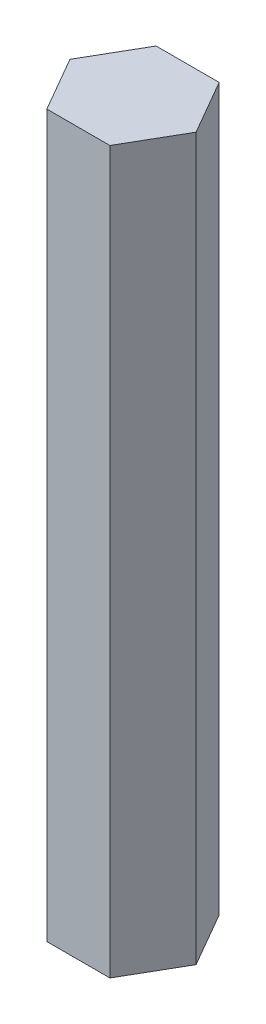
ISO-10303-21;
HEADER;
FILE_DESCRIPTION(('STEP AP214'),'2;1');
FILE_NAME('part.step','',(''),(''),'','','');
FILE_SCHEMA(('AUTOMOTIVE_DESIGN { 1 0 10303 214 1 1 1 1 }'));
ENDSEC;
DATA;
#1=APPLICATION_CONTEXT('core data for automotive mechanical design processes');
#2=APPLICATION_PROTOCOL_DEFINITION('international standard','automotive_design',2000,#1);
#3=PRODUCT_CONTEXT('',#1,'mechanical');
#4=PRODUCT('Part','Part','',(#3));
#5=PRODUCT_RELATED_PRODUCT_CATEGORY('part','',(#4));
#6=PRODUCT_DEFINITION_FORMATION('','',#4);
#7=PRODUCT_DEFINITION_CONTEXT('part definition',#1,'design');
#8=PRODUCT_DEFINITION('design','',#6,#7);
#9=PRODUCT_DEFINITION_SHAPE('','',#8);
#10=(LENGTH_UNIT() NAMED_UNIT(*) SI_UNIT(.MILLI.,.METRE.));
#11=(NAMED_UNIT(*) PLANE_ANGLE_UNIT() SI_UNIT($,.RADIAN.));
#12=(NAMED_UNIT(*) SI_UNIT($,.STERADIAN.) SOLID_ANGLE_UNIT());
#13=UNCERTAINTY_MEASURE_WITH_UNIT(LENGTH_MEASURE(1.E-05),#10,'distance_accuracy_value','');
#14=(GEOMETRIC_REPRESENTATION_CONTEXT(3) GLOBAL_UNCERTAINTY_ASSIGNED_CONTEXT((#13)) GLOBAL_UNIT_ASSIGNED_CONTEXT((#10,
#11,#12)) REPRESENTATION_CONTEXT('',''));
#15=CARTESIAN_POINT('',(0.,0.,0.));
#16=DIRECTION('',(0.,0.,1.));
#17=DIRECTION('',(1.,0.,0.));
#18=AXIS2_PLACEMENT_3D('',#15,#16,#17);
#19=CARTESIAN_POINT('',(7.33234841870825,83.82,0.));
#20=DIRECTION('',(-0.866025403784439,0.,0.5));
#21=DIRECTION('',(0.5,0.,0.866025403784439));
#22=AXIS2_PLACEMENT_3D('',#19,#20,#21);
#23=PLANE('',#22);
#24=DIRECTION('',(-0.5,0.,-0.866025403784438));
#25=VECTOR('',#24,1.);
#26=CARTESIAN_POINT('',(7.33234841870825,0.,0.));
#27=LINE('',#26,#25);
#28=CARTESIAN_POINT('',(7.33234841870825,0.,0.));
#29=VERTEX_POINT('',#28);
#30=CARTESIAN_POINT('',(3.66617420935412,0.,-6.35));
#31=VERTEX_POINT('',#30);
#32=EDGE_CURVE('E117',#29,#31,#27,.T.);
#33=ORIENTED_EDGE('',*,*,#32,.T.);
#34=DIRECTION('',(0.,-1.,0.));
#35=VECTOR('',#34,1.);
#36=CARTESIAN_POINT('',(3.66617420935412,83.82,-6.35));
#37=LINE('',#36,#35);
#38=CARTESIAN_POINT('',(3.66617420935412,83.82,-6.35));
#39=VERTEX_POINT('',#38);
#40=EDGE_CURVE('E11',#39,#31,#37,.T.);
#41=ORIENTED_EDGE('',*,*,#40,.F.);
#42=DIRECTION('',(-0.5,0.,-0.866025403784438));
#43=VECTOR('',#42,1.);
#44=CARTESIAN_POINT('',(7.33234841870825,83.82,0.));
#45=LINE('',#44,#43);
#46=CARTESIAN_POINT('',(7.33234841870825,83.82,0.));
#47=VERTEX_POINT('',#46);
#48=EDGE_CURVE('E127',#47,#39,#45,.T.);
#49=ORIENTED_EDGE('',*,*,#48,.F.);
#50=DIRECTION('',(0.,-1.,0.));
#51=VECTOR('',#50,1.);
#52=CARTESIAN_POINT('',(7.33234841870825,83.82,0.));
#53=LINE('',#52,#51);
#54=EDGE_CURVE('E113',#47,#29,#53,.T.);
#55=ORIENTED_EDGE('',*,*,#54,.T.);
#56=EDGE_LOOP('',(#33,#41,#49,#55));
#57=FACE_BOUND('',#56,.T.);
#58=ADVANCED_FACE('F33',(#57),#23,.F.);
#59=CARTESIAN_POINT('',(3.66617420935412,83.82,-6.35));
#60=DIRECTION('',(0.,0.,1.));
#61=DIRECTION('',(1.,0.,0.));
#62=AXIS2_PLACEMENT_3D('',#59,#60,#61);
#63=PLANE('',#62);
#64=DIRECTION('',(-1.,0.,0.));
#65=VECTOR('',#64,1.);
#66=CARTESIAN_POINT('',(3.66617420935412,0.,-6.35));
#67=LINE('',#66,#65);
#68=CARTESIAN_POINT('',(-3.66617420935412,0.,-6.35));
#69=VERTEX_POINT('',#68);
#70=EDGE_CURVE('E120',#31,#69,#67,.T.);
#71=ORIENTED_EDGE('',*,*,#70,.T.);
#72=DIRECTION('',(0.,-1.,0.));
#73=VECTOR('',#72,1.);
#74=CARTESIAN_POINT('',(-3.66617420935412,83.82,-6.35));
#75=LINE('',#74,#73);
#76=CARTESIAN_POINT('',(-3.66617420935412,83.82,-6.35));
#77=VERTEX_POINT('',#76);
#78=EDGE_CURVE('E41',#77,#69,#75,.T.);
#79=ORIENTED_EDGE('',*,*,#78,.F.);
#80=DIRECTION('',(-1.,0.,0.));
#81=VECTOR('',#80,1.);
#82=CARTESIAN_POINT('',(3.66617420935412,83.82,-6.35));
#83=LINE('',#82,#81);
#84=EDGE_CURVE('E86',#39,#77,#83,.T.);
#85=ORIENTED_EDGE('',*,*,#84,.F.);
#86=ORIENTED_EDGE('',*,*,#40,.T.);
#87=EDGE_LOOP('',(#71,#79,#85,#86));
#88=FACE_BOUND('',#87,.T.);
#89=ADVANCED_FACE('F151',(#88),#63,.F.);
#90=CARTESIAN_POINT('',(-3.66617420935412,83.82,-6.35));
#91=DIRECTION('',(0.866025403784439,0.,0.5));
#92=DIRECTION('',(0.5,0.,-0.866025403784439));
#93=AXIS2_PLACEMENT_3D('',#90,#91,#92);
#94=PLANE('',#93);
#95=DIRECTION('',(-0.5,0.,0.866025403784439));
#96=VECTOR('',#95,1.);
#97=CARTESIAN_POINT('',(-3.66617420935412,0.,-6.35));
#98=LINE('',#97,#96);
#99=CARTESIAN_POINT('',(-7.33234841870824,0.,0.));
#100=VERTEX_POINT('',#99);
#101=EDGE_CURVE('E122',#69,#100,#98,.T.);
#102=ORIENTED_EDGE('',*,*,#101,.T.);
#103=DIRECTION('',(0.,-1.,0.));
#104=VECTOR('',#103,1.);
#105=CARTESIAN_POINT('',(-7.33234841870824,83.82,0.));
#106=LINE('',#105,#104);
#107=CARTESIAN_POINT('',(-7.33234841870824,83.82,0.));
#108=VERTEX_POINT('',#107);
#109=EDGE_CURVE('E108',#108,#100,#106,.T.);
#110=ORIENTED_EDGE('',*,*,#109,.F.);
#111=DIRECTION('',(-0.5,0.,0.866025403784439));
#112=VECTOR('',#111,1.);
#113=CARTESIAN_POINT('',(-3.66617420935412,83.82,-6.35));
#114=LINE('',#113,#112);
#115=EDGE_CURVE('E99',#77,#108,#114,.T.);
#116=ORIENTED_EDGE('',*,*,#115,.F.);
#117=ORIENTED_EDGE('',*,*,#78,.T.);
#118=EDGE_LOOP('',(#102,#110,#116,#117));
#119=FACE_BOUND('',#118,.T.);
#120=ADVANCED_FACE('F133',(#119),#94,.F.);
#121=CARTESIAN_POINT('',(-7.33234841870824,83.82,0.));
#122=DIRECTION('',(0.866025403784438,0.,-0.5));
#123=DIRECTION('',(-0.5,0.,-0.866025403784439));
#124=AXIS2_PLACEMENT_3D('',#121,#122,#123);
#125=PLANE('',#124);
#126=DIRECTION('',(0.5,0.,0.866025403784438));
#127=VECTOR('',#126,1.);
#128=CARTESIAN_POINT('',(-7.33234841870824,0.,0.));
#129=LINE('',#128,#127);
#130=CARTESIAN_POINT('',(-3.66617420935412,0.,6.35));
#131=VERTEX_POINT('',#130);
#132=EDGE_CURVE('E107',#100,#131,#129,.T.);
#133=ORIENTED_EDGE('',*,*,#132,.T.);
#134=DIRECTION('',(0.,-1.,0.));
#135=VECTOR('',#134,1.);
#136=CARTESIAN_POINT('',(-3.66617420935412,83.82,6.35));
#137=LINE('',#136,#135);
#138=CARTESIAN_POINT('',(-3.66617420935412,83.82,6.35));
#139=VERTEX_POINT('',#138);
#140=EDGE_CURVE('E104',#139,#131,#137,.T.);
#141=ORIENTED_EDGE('',*,*,#140,.F.);
#142=DIRECTION('',(0.5,0.,0.866025403784438));
#143=VECTOR('',#142,1.);
#144=CARTESIAN_POINT('',(-7.33234841870824,83.82,0.));
#145=LINE('',#144,#143);
#146=EDGE_CURVE('E93',#108,#139,#145,.T.);
#147=ORIENTED_EDGE('',*,*,#146,.F.);
#148=ORIENTED_EDGE('',*,*,#109,.T.);
#149=EDGE_LOOP('',(#133,#141,#147,#148));
#150=FACE_BOUND('',#149,.T.);
#151=ADVANCED_FACE('F105',(#150),#125,.F.);
#152=CARTESIAN_POINT('',(-3.66617420935412,83.82,6.35));
#153=DIRECTION('',(0.,0.,-1.));
#154=DIRECTION('',(-1.,0.,0.));
#155=AXIS2_PLACEMENT_3D('',#152,#153,#154);
#156=PLANE('',#155);
#157=DIRECTION('',(1.,0.,0.));
#158=VECTOR('',#157,1.);
#159=CARTESIAN_POINT('',(-3.66617420935412,0.,6.35));
#160=LINE('',#159,#158);
#161=CARTESIAN_POINT('',(3.66617420935412,0.,6.35));
#162=VERTEX_POINT('',#161);
#163=EDGE_CURVE('E72',#131,#162,#160,.T.);
#164=ORIENTED_EDGE('',*,*,#163,.T.);
#165=DIRECTION('',(0.,-1.,0.));
#166=VECTOR('',#165,1.);
#167=CARTESIAN_POINT('',(3.66617420935412,83.82,6.35));
#168=LINE('',#167,#166);
#169=CARTESIAN_POINT('',(3.66617420935412,83.82,6.35));
#170=VERTEX_POINT('',#169);
#171=EDGE_CURVE('E109',#170,#162,#168,.T.);
#172=ORIENTED_EDGE('',*,*,#171,.F.);
#173=DIRECTION('',(1.,0.,0.));
#174=VECTOR('',#173,1.);
#175=CARTESIAN_POINT('',(-3.66617420935412,83.82,6.35));
#176=LINE('',#175,#174);
#177=EDGE_CURVE('E97',#139,#170,#176,.T.);
#178=ORIENTED_EDGE('',*,*,#177,.F.);
#179=ORIENTED_EDGE('',*,*,#140,.T.);
#180=EDGE_LOOP('',(#164,#172,#178,#179));
#181=FACE_BOUND('',#180,.T.);
#182=ADVANCED_FACE('F111',(#181),#156,.F.);
#183=CARTESIAN_POINT('',(3.66617420935412,83.82,6.35));
#184=DIRECTION('',(-0.866025403784439,0.,-0.5));
#185=DIRECTION('',(-0.5,0.,0.866025403784439));
#186=AXIS2_PLACEMENT_3D('',#183,#184,#185);
#187=PLANE('',#186);
#188=DIRECTION('',(0.5,0.,-0.866025403784439));
#189=VECTOR('',#188,1.);
#190=CARTESIAN_POINT('',(3.66617420935412,0.,6.35));
#191=LINE('',#190,#189);
#192=EDGE_CURVE('E78',#162,#29,#191,.T.);
#193=ORIENTED_EDGE('',*,*,#192,.T.);
#194=ORIENTED_EDGE('',*,*,#54,.F.);
#195=DIRECTION('',(0.5,0.,-0.866025403784439));
#196=VECTOR('',#195,1.);
#197=CARTESIAN_POINT('',(3.66617420935412,83.82,6.35));
#198=LINE('',#197,#196);
#199=EDGE_CURVE('E49',#170,#47,#198,.T.);
#200=ORIENTED_EDGE('',*,*,#199,.F.);
#201=ORIENTED_EDGE('',*,*,#171,.T.);
#202=EDGE_LOOP('',(#193,#194,#200,#201));
#203=FACE_BOUND('',#202,.T.);
#204=ADVANCED_FACE('F140',(#203),#187,.F.);
#205=CARTESIAN_POINT('',(0.,83.82,0.));
#206=DIRECTION('',(0.,1.,0.));
#207=DIRECTION('',(0.,0.,1.));
#208=AXIS2_PLACEMENT_3D('',#205,#206,#207);
#209=PLANE('',#208);
#210=ORIENTED_EDGE('',*,*,#48,.T.);
#211=ORIENTED_EDGE('',*,*,#84,.T.);
#212=ORIENTED_EDGE('',*,*,#115,.T.);
#213=ORIENTED_EDGE('',*,*,#146,.T.);
#214=ORIENTED_EDGE('',*,*,#177,.T.);
#215=ORIENTED_EDGE('',*,*,#199,.T.);
#216=EDGE_LOOP('',(#210,#211,#212,#213,#214,#215));
#217=FACE_BOUND('',#216,.T.);
#218=ADVANCED_FACE('F95',(#217),#209,.T.);
#219=CARTESIAN_POINT('',(0.,0.,0.));
#220=DIRECTION('',(0.,1.,0.));
#221=DIRECTION('',(0.,0.,1.));
#222=AXIS2_PLACEMENT_3D('',#219,#220,#221);
#223=PLANE('',#222);
#224=ORIENTED_EDGE('',*,*,#32,.F.);
#225=ORIENTED_EDGE('',*,*,#192,.F.);
#226=ORIENTED_EDGE('',*,*,#163,.F.);
#227=ORIENTED_EDGE('',*,*,#132,.F.);
#228=ORIENTED_EDGE('',*,*,#101,.F.);
#229=ORIENTED_EDGE('',*,*,#70,.F.);
#230=EDGE_LOOP('',(#224,#225,#226,#227,#228,#229));
#231=FACE_BOUND('',#230,.T.);
#232=ADVANCED_FACE('F136',(#231),#223,.F.);
#233=CLOSED_SHELL('',(#58,#89,#120,#151,#182,#204,#218,#232));
#234=MANIFOLD_SOLID_BREP('B2',#233);
#235=ADVANCED_BREP_SHAPE_REPRESENTATION('',(#18,#234),#14);
#236=SHAPE_DEFINITION_REPRESENTATION(#9,#235);
ENDSEC;
END-ISO-10303-21;
